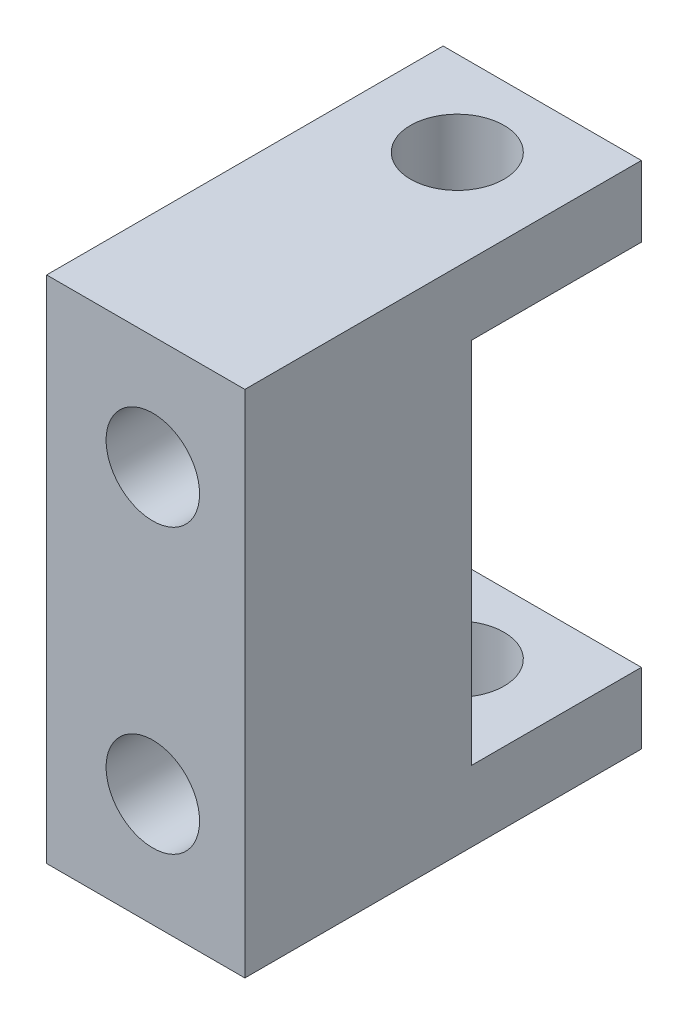
ISO-10303-21;
HEADER;
FILE_DESCRIPTION(('STEP AP214'),'2;1');
FILE_NAME('part.step','',(''),(''),'','','');
FILE_SCHEMA(('AUTOMOTIVE_DESIGN { 1 0 10303 214 1 1 1 1 }'));
ENDSEC;
DATA;
#1=APPLICATION_CONTEXT('core data for automotive mechanical design processes');
#2=APPLICATION_PROTOCOL_DEFINITION('international standard','automotive_design',2000,#1);
#3=PRODUCT_CONTEXT('',#1,'mechanical');
#4=PRODUCT('Part','Part','',(#3));
#5=PRODUCT_RELATED_PRODUCT_CATEGORY('part','',(#4));
#6=PRODUCT_DEFINITION_FORMATION('','',#4);
#7=PRODUCT_DEFINITION_CONTEXT('part definition',#1,'design');
#8=PRODUCT_DEFINITION('design','',#6,#7);
#9=PRODUCT_DEFINITION_SHAPE('','',#8);
#10=(LENGTH_UNIT() NAMED_UNIT(*) SI_UNIT(.MILLI.,.METRE.));
#11=(NAMED_UNIT(*) PLANE_ANGLE_UNIT() SI_UNIT($,.RADIAN.));
#12=(NAMED_UNIT(*) SI_UNIT($,.STERADIAN.) SOLID_ANGLE_UNIT());
#13=UNCERTAINTY_MEASURE_WITH_UNIT(LENGTH_MEASURE(1.E-05),#10,'distance_accuracy_value','');
#14=(GEOMETRIC_REPRESENTATION_CONTEXT(3) GLOBAL_UNCERTAINTY_ASSIGNED_CONTEXT((#13)) GLOBAL_UNIT_ASSIGNED_CONTEXT((#10,
#11,#12)) REPRESENTATION_CONTEXT('',''));
#15=CARTESIAN_POINT('',(0.,0.,0.));
#16=DIRECTION('',(0.,0.,1.));
#17=DIRECTION('',(1.,0.,0.));
#18=AXIS2_PLACEMENT_3D('',#15,#16,#17);
#19=CARTESIAN_POINT('',(0.,18.,0.));
#20=DIRECTION('',(0.,0.,-1.));
#21=DIRECTION('',(-1.,0.,0.));
#22=AXIS2_PLACEMENT_3D('',#19,#20,#21);
#23=PLANE('',#22);
#24=DIRECTION('',(0.,1.,0.));
#25=VECTOR('',#24,1.);
#26=CARTESIAN_POINT('',(0.,0.,0.));
#27=LINE('',#26,#25);
#28=CARTESIAN_POINT('',(0.,2.5,0.));
#29=VERTEX_POINT('',#28);
#30=CARTESIAN_POINT('',(0.,15.5,0.));
#31=VERTEX_POINT('',#30);
#32=EDGE_CURVE('E48',#29,#31,#27,.T.);
#33=ORIENTED_EDGE('',*,*,#32,.F.);
#34=DIRECTION('',(1.,0.,0.));
#35=VECTOR('',#34,1.);
#36=CARTESIAN_POINT('',(0.,2.5,0.));
#37=LINE('',#36,#35);
#38=CARTESIAN_POINT('',(-2.56261364575664,2.5,0.));
#39=VERTEX_POINT('',#38);
#40=EDGE_CURVE('E139',#39,#29,#37,.T.);
#41=ORIENTED_EDGE('',*,*,#40,.F.);
#42=CARTESIAN_POINT('',(-3.25,4.,0.));
#43=DIRECTION('',(0.,0.,1.));
#44=DIRECTION('',(1.,0.,0.));
#45=AXIS2_PLACEMENT_3D('',#42,#43,#44);
#46=CIRCLE('',#45,1.65);
#47=CARTESIAN_POINT('',(-3.93738635424336,2.5,0.));
#48=VERTEX_POINT('',#47);
#49=EDGE_CURVE('E181',#39,#48,#46,.T.);
#50=ORIENTED_EDGE('',*,*,#49,.T.);
#51=CARTESIAN_POINT('',(-7.,2.5,0.));
#52=VERTEX_POINT('',#51);
#53=EDGE_CURVE('E55',#52,#48,#37,.T.);
#54=ORIENTED_EDGE('',*,*,#53,.F.);
#55=DIRECTION('',(0.,-1.,0.));
#56=VECTOR('',#55,1.);
#57=CARTESIAN_POINT('',(-7.,18.,0.));
#58=LINE('',#57,#56);
#59=CARTESIAN_POINT('',(-7.,15.5,0.));
#60=VERTEX_POINT('',#59);
#61=EDGE_CURVE('E185',#60,#52,#58,.T.);
#62=ORIENTED_EDGE('',*,*,#61,.F.);
#63=DIRECTION('',(-1.,0.,0.));
#64=VECTOR('',#63,1.);
#65=CARTESIAN_POINT('',(0.,15.5,0.));
#66=LINE('',#65,#64);
#67=CARTESIAN_POINT('',(-3.93738635424337,15.5,0.));
#68=VERTEX_POINT('',#67);
#69=EDGE_CURVE('E11',#68,#60,#66,.T.);
#70=ORIENTED_EDGE('',*,*,#69,.F.);
#71=CARTESIAN_POINT('',(-3.25,14.,0.));
#72=DIRECTION('',(0.,0.,1.));
#73=DIRECTION('',(1.,0.,0.));
#74=AXIS2_PLACEMENT_3D('',#71,#72,#73);
#75=CIRCLE('',#74,1.65);
#76=CARTESIAN_POINT('',(-2.56261364575662,15.5,0.));
#77=VERTEX_POINT('',#76);
#78=EDGE_CURVE('E399',#68,#77,#75,.T.);
#79=ORIENTED_EDGE('',*,*,#78,.T.);
#80=EDGE_CURVE('E156',#31,#77,#66,.T.);
#81=ORIENTED_EDGE('',*,*,#80,.F.);
#82=EDGE_LOOP('',(#33,#41,#50,#54,#62,#70,#79,#81));
#83=FACE_BOUND('',#82,.T.);
#84=ADVANCED_FACE('F31',(#83),#23,.T.);
#85=CARTESIAN_POINT('',(0.,18.,8.));
#86=DIRECTION('',(0.,0.,-1.));
#87=DIRECTION('',(-1.,0.,0.));
#88=AXIS2_PLACEMENT_3D('',#85,#86,#87);
#89=PLANE('',#88);
#90=DIRECTION('',(0.,1.,0.));
#91=VECTOR('',#90,1.);
#92=CARTESIAN_POINT('',(0.,0.,8.));
#93=LINE('',#92,#91);
#94=CARTESIAN_POINT('',(0.,0.,8.));
#95=VERTEX_POINT('',#94);
#96=CARTESIAN_POINT('',(0.,18.,8.));
#97=VERTEX_POINT('',#96);
#98=EDGE_CURVE('E118',#95,#97,#93,.T.);
#99=ORIENTED_EDGE('',*,*,#98,.T.);
#100=DIRECTION('',(-1.,0.,0.));
#101=VECTOR('',#100,1.);
#102=CARTESIAN_POINT('',(-7.,18.,8.));
#103=LINE('',#102,#101);
#104=CARTESIAN_POINT('',(-7.,18.,8.));
#105=VERTEX_POINT('',#104);
#106=EDGE_CURVE('E211',#97,#105,#103,.T.);
#107=ORIENTED_EDGE('',*,*,#106,.T.);
#108=DIRECTION('',(0.,-1.,0.));
#109=VECTOR('',#108,1.);
#110=CARTESIAN_POINT('',(-7.,18.,8.));
#111=LINE('',#110,#109);
#112=CARTESIAN_POINT('',(-7.,0.,8.));
#113=VERTEX_POINT('',#112);
#114=EDGE_CURVE('E203',#105,#113,#111,.T.);
#115=ORIENTED_EDGE('',*,*,#114,.T.);
#116=DIRECTION('',(1.,0.,0.));
#117=VECTOR('',#116,1.);
#118=CARTESIAN_POINT('',(-7.,0.,8.));
#119=LINE('',#118,#117);
#120=EDGE_CURVE('E122',#113,#95,#119,.T.);
#121=ORIENTED_EDGE('',*,*,#120,.T.);
#122=EDGE_LOOP('',(#99,#107,#115,#121));
#123=FACE_BOUND('',#122,.T.);
#124=CARTESIAN_POINT('',(-3.25,14.,8.));
#125=DIRECTION('',(0.,0.,1.));
#126=DIRECTION('',(1.,0.,0.));
#127=AXIS2_PLACEMENT_3D('',#124,#125,#126);
#128=CIRCLE('',#127,1.64999999999999);
#129=CARTESIAN_POINT('',(-1.60000000000001,14.,8.));
#130=VERTEX_POINT('',#129);
#131=EDGE_CURVE('E186',#130,#130,#128,.T.);
#132=ORIENTED_EDGE('',*,*,#131,.F.);
#133=EDGE_LOOP('',(#132));
#134=FACE_BOUND('',#133,.T.);
#135=CARTESIAN_POINT('',(-3.25,4.,8.));
#136=DIRECTION('',(0.,0.,1.));
#137=DIRECTION('',(1.,0.,0.));
#138=AXIS2_PLACEMENT_3D('',#135,#136,#137);
#139=CIRCLE('',#138,1.64999999999999);
#140=CARTESIAN_POINT('',(-1.60000000000001,4.,8.));
#141=VERTEX_POINT('',#140);
#142=EDGE_CURVE('E397',#141,#141,#139,.T.);
#143=ORIENTED_EDGE('',*,*,#142,.F.);
#144=EDGE_LOOP('',(#143));
#145=FACE_BOUND('',#144,.T.);
#146=ADVANCED_FACE('F243',(#123,#134,#145),#89,.F.);
#147=CARTESIAN_POINT('',(0.,0.,8.));
#148=DIRECTION('',(-1.,0.,0.));
#149=DIRECTION('',(0.,0.,1.));
#150=AXIS2_PLACEMENT_3D('',#147,#148,#149);
#151=PLANE('',#150);
#152=DIRECTION('',(0.,0.,-1.));
#153=VECTOR('',#152,1.);
#154=CARTESIAN_POINT('',(0.,0.,8.));
#155=LINE('',#154,#153);
#156=CARTESIAN_POINT('',(0.,0.,-6.));
#157=VERTEX_POINT('',#156);
#158=EDGE_CURVE('E111',#95,#157,#155,.T.);
#159=ORIENTED_EDGE('',*,*,#158,.T.);
#160=DIRECTION('',(0.,-1.,0.));
#161=VECTOR('',#160,1.);
#162=CARTESIAN_POINT('',(0.,0.,-6.));
#163=LINE('',#162,#161);
#164=CARTESIAN_POINT('',(0.,2.5,-6.));
#165=VERTEX_POINT('',#164);
#166=EDGE_CURVE('E115',#165,#157,#163,.T.);
#167=ORIENTED_EDGE('',*,*,#166,.F.);
#168=DIRECTION('',(0.,0.,1.));
#169=VECTOR('',#168,1.);
#170=CARTESIAN_POINT('',(0.,2.5,-6.));
#171=LINE('',#170,#169);
#172=EDGE_CURVE('E145',#165,#29,#171,.T.);
#173=ORIENTED_EDGE('',*,*,#172,.T.);
#174=ORIENTED_EDGE('',*,*,#32,.T.);
#175=DIRECTION('',(0.,0.,1.));
#176=VECTOR('',#175,1.);
#177=CARTESIAN_POINT('',(0.,15.5,-6.));
#178=LINE('',#177,#176);
#179=CARTESIAN_POINT('',(0.,15.5,-6.));
#180=VERTEX_POINT('',#179);
#181=EDGE_CURVE('E178',#180,#31,#178,.T.);
#182=ORIENTED_EDGE('',*,*,#181,.F.);
#183=DIRECTION('',(0.,-1.,0.));
#184=VECTOR('',#183,1.);
#185=CARTESIAN_POINT('',(0.,18.,-6.));
#186=LINE('',#185,#184);
#187=CARTESIAN_POINT('',(0.,18.,-6.));
#188=VERTEX_POINT('',#187);
#189=EDGE_CURVE('E152',#188,#180,#186,.T.);
#190=ORIENTED_EDGE('',*,*,#189,.F.);
#191=DIRECTION('',(0.,0.,-1.));
#192=VECTOR('',#191,1.);
#193=CARTESIAN_POINT('',(0.,18.,8.));
#194=LINE('',#193,#192);
#195=EDGE_CURVE('E40',#97,#188,#194,.T.);
#196=ORIENTED_EDGE('',*,*,#195,.F.);
#197=ORIENTED_EDGE('',*,*,#98,.F.);
#198=EDGE_LOOP('',(#159,#167,#173,#174,#182,#190,#196,#197));
#199=FACE_BOUND('',#198,.T.);
#200=ADVANCED_FACE('F33',(#199),#151,.F.);
#201=CARTESIAN_POINT('',(-7.,18.,8.));
#202=DIRECTION('',(0.,-1.,0.));
#203=DIRECTION('',(0.,0.,-1.));
#204=AXIS2_PLACEMENT_3D('',#201,#202,#203);
#205=PLANE('',#204);
#206=CARTESIAN_POINT('',(-3.5,18.,-3.));
#207=DIRECTION('',(0.,1.,0.));
#208=DIRECTION('',(0.,0.,1.));
#209=AXIS2_PLACEMENT_3D('',#206,#207,#208);
#210=CIRCLE('',#209,1.64999999999999);
#211=CARTESIAN_POINT('',(-3.5,18.,-1.35000000000001));
#212=VERTEX_POINT('',#211);
#213=EDGE_CURVE('E228',#212,#212,#210,.T.);
#214=ORIENTED_EDGE('',*,*,#213,.F.);
#215=EDGE_LOOP('',(#214));
#216=FACE_BOUND('',#215,.T.);
#217=ORIENTED_EDGE('',*,*,#195,.T.);
#218=DIRECTION('',(1.,0.,0.));
#219=VECTOR('',#218,1.);
#220=CARTESIAN_POINT('',(0.,18.,-6.));
#221=LINE('',#220,#219);
#222=CARTESIAN_POINT('',(-7.,18.,-6.));
#223=VERTEX_POINT('',#222);
#224=EDGE_CURVE('E161',#223,#188,#221,.T.);
#225=ORIENTED_EDGE('',*,*,#224,.F.);
#226=DIRECTION('',(0.,0.,-1.));
#227=VECTOR('',#226,1.);
#228=CARTESIAN_POINT('',(-7.,18.,8.));
#229=LINE('',#228,#227);
#230=EDGE_CURVE('E196',#105,#223,#229,.T.);
#231=ORIENTED_EDGE('',*,*,#230,.F.);
#232=ORIENTED_EDGE('',*,*,#106,.F.);
#233=EDGE_LOOP('',(#217,#225,#231,#232));
#234=FACE_BOUND('',#233,.T.);
#235=ADVANCED_FACE('F210',(#216,#234),#205,.F.);
#236=CARTESIAN_POINT('',(-7.,18.,8.));
#237=DIRECTION('',(1.,0.,0.));
#238=DIRECTION('',(0.,1.,0.));
#239=AXIS2_PLACEMENT_3D('',#236,#237,#238);
#240=PLANE('',#239);
#241=ORIENTED_EDGE('',*,*,#230,.T.);
#242=DIRECTION('',(0.,1.,0.));
#243=VECTOR('',#242,1.);
#244=CARTESIAN_POINT('',(-7.,18.,-6.));
#245=LINE('',#244,#243);
#246=CARTESIAN_POINT('',(-7.,15.5,-6.));
#247=VERTEX_POINT('',#246);
#248=EDGE_CURVE('E158',#247,#223,#245,.T.);
#249=ORIENTED_EDGE('',*,*,#248,.F.);
#250=DIRECTION('',(0.,0.,1.));
#251=VECTOR('',#250,1.);
#252=CARTESIAN_POINT('',(-7.,15.5,-6.));
#253=LINE('',#252,#251);
#254=EDGE_CURVE('E164',#247,#60,#253,.T.);
#255=ORIENTED_EDGE('',*,*,#254,.T.);
#256=ORIENTED_EDGE('',*,*,#61,.T.);
#257=DIRECTION('',(0.,0.,1.));
#258=VECTOR('',#257,1.);
#259=CARTESIAN_POINT('',(-7.,2.5,-6.));
#260=LINE('',#259,#258);
#261=CARTESIAN_POINT('',(-7.,2.5,-6.));
#262=VERTEX_POINT('',#261);
#263=EDGE_CURVE('E148',#262,#52,#260,.T.);
#264=ORIENTED_EDGE('',*,*,#263,.F.);
#265=DIRECTION('',(0.,1.,0.));
#266=VECTOR('',#265,1.);
#267=CARTESIAN_POINT('',(-7.,0.,-6.));
#268=LINE('',#267,#266);
#269=CARTESIAN_POINT('',(-7.,0.,-6.));
#270=VERTEX_POINT('',#269);
#271=EDGE_CURVE('E130',#270,#262,#268,.T.);
#272=ORIENTED_EDGE('',*,*,#271,.F.);
#273=DIRECTION('',(0.,0.,-1.));
#274=VECTOR('',#273,1.);
#275=CARTESIAN_POINT('',(-7.,0.,8.));
#276=LINE('',#275,#274);
#277=EDGE_CURVE('E121',#113,#270,#276,.T.);
#278=ORIENTED_EDGE('',*,*,#277,.F.);
#279=ORIENTED_EDGE('',*,*,#114,.F.);
#280=EDGE_LOOP('',(#241,#249,#255,#256,#264,#272,#278,#279));
#281=FACE_BOUND('',#280,.T.);
#282=ADVANCED_FACE('F201',(#281),#240,.F.);
#283=CARTESIAN_POINT('',(-7.,0.,8.));
#284=DIRECTION('',(0.,1.,0.));
#285=DIRECTION('',(0.,0.,1.));
#286=AXIS2_PLACEMENT_3D('',#283,#284,#285);
#287=PLANE('',#286);
#288=CARTESIAN_POINT('',(-3.5,0.,-3.));
#289=DIRECTION('',(0.,-1.,0.));
#290=DIRECTION('',(0.,0.,-1.));
#291=AXIS2_PLACEMENT_3D('',#288,#289,#290);
#292=CIRCLE('',#291,1.64999999999999);
#293=CARTESIAN_POINT('',(-3.5,0.,-4.64999999999999));
#294=VERTEX_POINT('',#293);
#295=EDGE_CURVE('E141',#294,#294,#292,.T.);
#296=ORIENTED_EDGE('',*,*,#295,.F.);
#297=EDGE_LOOP('',(#296));
#298=FACE_BOUND('',#297,.T.);
#299=ORIENTED_EDGE('',*,*,#277,.T.);
#300=DIRECTION('',(-1.,0.,0.));
#301=VECTOR('',#300,1.);
#302=CARTESIAN_POINT('',(0.,0.,-6.));
#303=LINE('',#302,#301);
#304=EDGE_CURVE('E125',#157,#270,#303,.T.);
#305=ORIENTED_EDGE('',*,*,#304,.F.);
#306=ORIENTED_EDGE('',*,*,#158,.F.);
#307=ORIENTED_EDGE('',*,*,#120,.F.);
#308=EDGE_LOOP('',(#299,#305,#306,#307));
#309=FACE_BOUND('',#308,.T.);
#310=ADVANCED_FACE('F126',(#298,#309),#287,.F.);
#311=CARTESIAN_POINT('',(-3.25,14.,8.));
#312=DIRECTION('',(0.,0.,1.));
#313=DIRECTION('',(1.,0.,0.));
#314=AXIS2_PLACEMENT_3D('',#311,#312,#313);
#315=CYLINDRICAL_SURFACE('',#314,1.64999999999999);
#316=EDGE_CURVE('E403',#77,#68,#75,.T.);
#317=ORIENTED_EDGE('',*,*,#316,.F.);
#318=ORIENTED_EDGE('',*,*,#78,.F.);
#319=EDGE_LOOP('',(#317,#318));
#320=FACE_BOUND('',#319,.T.);
#321=ORIENTED_EDGE('',*,*,#131,.T.);
#322=EDGE_LOOP('',(#321));
#323=FACE_BOUND('',#322,.T.);
#324=ADVANCED_FACE('F254',(#320,#323),#315,.F.);
#325=CARTESIAN_POINT('',(-3.25,4.,8.));
#326=DIRECTION('',(0.,0.,1.));
#327=DIRECTION('',(1.,0.,0.));
#328=AXIS2_PLACEMENT_3D('',#325,#326,#327);
#329=CYLINDRICAL_SURFACE('',#328,1.64999999999999);
#330=EDGE_CURVE('E168',#48,#39,#46,.T.);
#331=ORIENTED_EDGE('',*,*,#330,.F.);
#332=ORIENTED_EDGE('',*,*,#49,.F.);
#333=EDGE_LOOP('',(#331,#332));
#334=FACE_BOUND('',#333,.T.);
#335=ORIENTED_EDGE('',*,*,#142,.T.);
#336=EDGE_LOOP('',(#335));
#337=FACE_BOUND('',#336,.T.);
#338=ADVANCED_FACE('F259',(#334,#337),#329,.F.);
#339=CARTESIAN_POINT('',(0.,15.5,0.));
#340=DIRECTION('',(0.,0.,-1.));
#341=DIRECTION('',(-1.,0.,0.));
#342=AXIS2_PLACEMENT_3D('',#339,#340,#341);
#343=PLANE('',#342);
#344=EDGE_CURVE('E151',#77,#68,#66,.T.);
#345=ORIENTED_EDGE('',*,*,#344,.F.);
#346=ORIENTED_EDGE('',*,*,#316,.T.);
#347=EDGE_LOOP('',(#345,#346));
#348=FACE_BOUND('',#347,.T.);
#349=ADVANCED_FACE('F264',(#348),#343,.F.);
#350=CARTESIAN_POINT('',(0.,15.5,-6.));
#351=DIRECTION('',(0.,1.,0.));
#352=DIRECTION('',(0.,0.,1.));
#353=AXIS2_PLACEMENT_3D('',#350,#351,#352);
#354=PLANE('',#353);
#355=CARTESIAN_POINT('',(-3.5,15.5,-3.));
#356=DIRECTION('',(0.,1.,0.));
#357=DIRECTION('',(0.,0.,1.));
#358=AXIS2_PLACEMENT_3D('',#355,#356,#357);
#359=CIRCLE('',#358,1.64999999999999);
#360=CARTESIAN_POINT('',(-3.5,15.5,-1.35000000000001));
#361=VERTEX_POINT('',#360);
#362=EDGE_CURVE('E35',#361,#361,#359,.T.);
#363=ORIENTED_EDGE('',*,*,#362,.T.);
#364=EDGE_LOOP('',(#363));
#365=FACE_BOUND('',#364,.T.);
#366=ORIENTED_EDGE('',*,*,#80,.T.);
#367=ORIENTED_EDGE('',*,*,#344,.T.);
#368=ORIENTED_EDGE('',*,*,#69,.T.);
#369=ORIENTED_EDGE('',*,*,#254,.F.);
#370=DIRECTION('',(-1.,0.,0.));
#371=VECTOR('',#370,1.);
#372=CARTESIAN_POINT('',(0.,15.5,-6.));
#373=LINE('',#372,#371);
#374=EDGE_CURVE('E155',#180,#247,#373,.T.);
#375=ORIENTED_EDGE('',*,*,#374,.F.);
#376=ORIENTED_EDGE('',*,*,#181,.T.);
#377=EDGE_LOOP('',(#366,#367,#368,#369,#375,#376));
#378=FACE_BOUND('',#377,.T.);
#379=ADVANCED_FACE('F214',(#365,#378),#354,.F.);
#380=CARTESIAN_POINT('',(0.,15.5,-6.));
#381=DIRECTION('',(0.,0.,-1.));
#382=DIRECTION('',(-1.,0.,0.));
#383=AXIS2_PLACEMENT_3D('',#380,#381,#382);
#384=PLANE('',#383);
#385=ORIENTED_EDGE('',*,*,#189,.T.);
#386=ORIENTED_EDGE('',*,*,#374,.T.);
#387=ORIENTED_EDGE('',*,*,#248,.T.);
#388=ORIENTED_EDGE('',*,*,#224,.T.);
#389=EDGE_LOOP('',(#385,#386,#387,#388));
#390=FACE_BOUND('',#389,.T.);
#391=ADVANCED_FACE('F207',(#390),#384,.T.);
#392=CARTESIAN_POINT('',(0.,2.5,0.));
#393=DIRECTION('',(0.,0.,1.));
#394=DIRECTION('',(1.,0.,0.));
#395=AXIS2_PLACEMENT_3D('',#392,#393,#394);
#396=PLANE('',#395);
#397=ORIENTED_EDGE('',*,*,#330,.T.);
#398=EDGE_CURVE('E137',#48,#39,#37,.T.);
#399=ORIENTED_EDGE('',*,*,#398,.F.);
#400=EDGE_LOOP('',(#397,#399));
#401=FACE_BOUND('',#400,.T.);
#402=ADVANCED_FACE('F277',(#401),#396,.T.);
#403=CARTESIAN_POINT('',(0.,2.5,-6.));
#404=DIRECTION('',(0.,-1.,0.));
#405=DIRECTION('',(0.,0.,-1.));
#406=AXIS2_PLACEMENT_3D('',#403,#404,#405);
#407=PLANE('',#406);
#408=CARTESIAN_POINT('',(-3.5,2.5,-3.));
#409=DIRECTION('',(0.,-1.,0.));
#410=DIRECTION('',(0.,0.,-1.));
#411=AXIS2_PLACEMENT_3D('',#408,#409,#410);
#412=CIRCLE('',#411,1.64999999999999);
#413=CARTESIAN_POINT('',(-3.5,2.5,-4.64999999999999));
#414=VERTEX_POINT('',#413);
#415=EDGE_CURVE('E187',#414,#414,#412,.T.);
#416=ORIENTED_EDGE('',*,*,#415,.T.);
#417=EDGE_LOOP('',(#416));
#418=FACE_BOUND('',#417,.T.);
#419=ORIENTED_EDGE('',*,*,#53,.T.);
#420=ORIENTED_EDGE('',*,*,#398,.T.);
#421=ORIENTED_EDGE('',*,*,#40,.T.);
#422=ORIENTED_EDGE('',*,*,#172,.F.);
#423=DIRECTION('',(1.,0.,0.));
#424=VECTOR('',#423,1.);
#425=CARTESIAN_POINT('',(0.,2.5,-6.));
#426=LINE('',#425,#424);
#427=EDGE_CURVE('E134',#262,#165,#426,.T.);
#428=ORIENTED_EDGE('',*,*,#427,.F.);
#429=ORIENTED_EDGE('',*,*,#263,.T.);
#430=EDGE_LOOP('',(#419,#420,#421,#422,#428,#429));
#431=FACE_BOUND('',#430,.T.);
#432=ADVANCED_FACE('F217',(#418,#431),#407,.F.);
#433=CARTESIAN_POINT('',(0.,2.5,-6.));
#434=DIRECTION('',(0.,0.,1.));
#435=DIRECTION('',(1.,0.,0.));
#436=AXIS2_PLACEMENT_3D('',#433,#434,#435);
#437=PLANE('',#436);
#438=ORIENTED_EDGE('',*,*,#166,.T.);
#439=ORIENTED_EDGE('',*,*,#304,.T.);
#440=ORIENTED_EDGE('',*,*,#271,.T.);
#441=ORIENTED_EDGE('',*,*,#427,.T.);
#442=EDGE_LOOP('',(#438,#439,#440,#441));
#443=FACE_BOUND('',#442,.T.);
#444=ADVANCED_FACE('F132',(#443),#437,.F.);
#445=CARTESIAN_POINT('',(-3.5,0.,-3.));
#446=DIRECTION('',(0.,-1.,0.));
#447=DIRECTION('',(0.,0.,-1.));
#448=AXIS2_PLACEMENT_3D('',#445,#446,#447);
#449=CYLINDRICAL_SURFACE('',#448,1.64999999999999);
#450=ORIENTED_EDGE('',*,*,#295,.T.);
#451=EDGE_LOOP('',(#450));
#452=FACE_BOUND('',#451,.T.);
#453=ORIENTED_EDGE('',*,*,#415,.F.);
#454=EDGE_LOOP('',(#453));
#455=FACE_BOUND('',#454,.T.);
#456=ADVANCED_FACE('F285',(#452,#455),#449,.F.);
#457=CARTESIAN_POINT('',(-3.5,18.,-3.));
#458=DIRECTION('',(0.,1.,0.));
#459=DIRECTION('',(0.,0.,1.));
#460=AXIS2_PLACEMENT_3D('',#457,#458,#459);
#461=CYLINDRICAL_SURFACE('',#460,1.64999999999999);
#462=ORIENTED_EDGE('',*,*,#213,.T.);
#463=EDGE_LOOP('',(#462));
#464=FACE_BOUND('',#463,.T.);
#465=ORIENTED_EDGE('',*,*,#362,.F.);
#466=EDGE_LOOP('',(#465));
#467=FACE_BOUND('',#466,.T.);
#468=ADVANCED_FACE('F234',(#464,#467),#461,.F.);
#469=CLOSED_SHELL('',(#84,#146,#200,#235,#282,#310,#324,#338,#349,#379,#391,#402,#432,#444,#456,#468));
#470=MANIFOLD_SOLID_BREP('B2',#469);
#471=ADVANCED_BREP_SHAPE_REPRESENTATION('',(#18,#470),#14);
#472=SHAPE_DEFINITION_REPRESENTATION(#9,#471);
ENDSEC;
END-ISO-10303-21;
